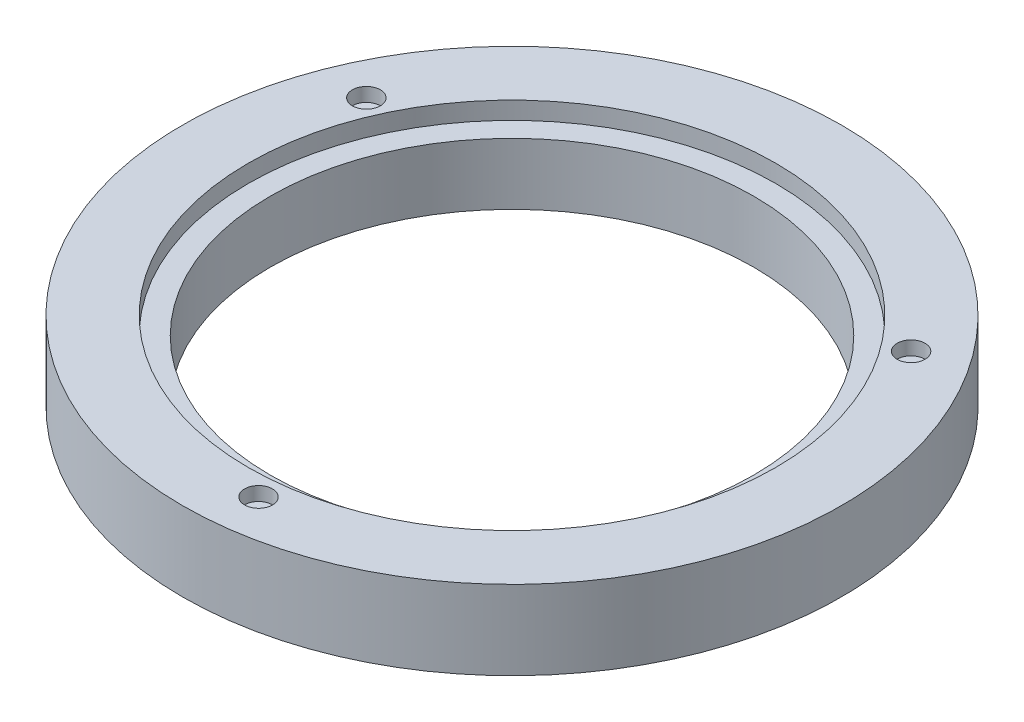
ISO-10303-21;
HEADER;
FILE_DESCRIPTION(('STEP AP214'),'2;1');
FILE_NAME('part.step','',(''),(''),'','','');
FILE_SCHEMA(('AUTOMOTIVE_DESIGN { 1 0 10303 214 1 1 1 1 }'));
ENDSEC;
DATA;
#1=APPLICATION_CONTEXT('core data for automotive mechanical design processes');
#2=APPLICATION_PROTOCOL_DEFINITION('international standard','automotive_design',2000,#1);
#3=PRODUCT_CONTEXT('',#1,'mechanical');
#4=PRODUCT('Part','Part','',(#3));
#5=PRODUCT_RELATED_PRODUCT_CATEGORY('part','',(#4));
#6=PRODUCT_DEFINITION_FORMATION('','',#4);
#7=PRODUCT_DEFINITION_CONTEXT('part definition',#1,'design');
#8=PRODUCT_DEFINITION('design','',#6,#7);
#9=PRODUCT_DEFINITION_SHAPE('','',#8);
#10=(LENGTH_UNIT() NAMED_UNIT(*) SI_UNIT(.MILLI.,.METRE.));
#11=(NAMED_UNIT(*) PLANE_ANGLE_UNIT() SI_UNIT($,.RADIAN.));
#12=(NAMED_UNIT(*) SI_UNIT($,.STERADIAN.) SOLID_ANGLE_UNIT());
#13=UNCERTAINTY_MEASURE_WITH_UNIT(LENGTH_MEASURE(1.E-05),#10,'distance_accuracy_value','');
#14=(GEOMETRIC_REPRESENTATION_CONTEXT(3) GLOBAL_UNCERTAINTY_ASSIGNED_CONTEXT((#13)) GLOBAL_UNIT_ASSIGNED_CONTEXT((#10,
#11,#12)) REPRESENTATION_CONTEXT('',''));
#15=CARTESIAN_POINT('',(0.,0.,0.));
#16=DIRECTION('',(0.,0.,1.));
#17=DIRECTION('',(1.,0.,0.));
#18=AXIS2_PLACEMENT_3D('',#15,#16,#17);
#19=CARTESIAN_POINT('',(0.,18.,0.));
#20=DIRECTION('',(0.,-1.,0.));
#21=DIRECTION('',(0.,0.,-1.));
#22=AXIS2_PLACEMENT_3D('',#19,#20,#21);
#23=CYLINDRICAL_SURFACE('',#22,55.);
#24=CARTESIAN_POINT('',(0.,0.,0.));
#25=DIRECTION('',(0.,1.,0.));
#26=DIRECTION('',(0.,0.,1.));
#27=AXIS2_PLACEMENT_3D('',#24,#25,#26);
#28=CIRCLE('',#27,55.);
#29=CARTESIAN_POINT('',(0.,0.,55.));
#30=VERTEX_POINT('',#29);
#31=EDGE_CURVE('E44',#30,#30,#28,.T.);
#32=ORIENTED_EDGE('',*,*,#31,.F.);
#33=EDGE_LOOP('',(#32));
#34=FACE_BOUND('',#33,.T.);
#35=CARTESIAN_POINT('',(0.,14.,0.));
#36=DIRECTION('',(0.,1.,0.));
#37=DIRECTION('',(0.,0.,1.));
#38=AXIS2_PLACEMENT_3D('',#35,#36,#37);
#39=CIRCLE('',#38,55.);
#40=CARTESIAN_POINT('',(0.,14.,55.));
#41=VERTEX_POINT('',#40);
#42=EDGE_CURVE('E52',#41,#41,#39,.T.);
#43=ORIENTED_EDGE('',*,*,#42,.T.);
#44=EDGE_LOOP('',(#43));
#45=FACE_BOUND('',#44,.T.);
#46=ADVANCED_FACE('F33',(#34,#45),#23,.F.);
#47=CARTESIAN_POINT('',(0.,18.,0.));
#48=DIRECTION('',(0.,1.,0.));
#49=DIRECTION('',(0.,0.,1.));
#50=AXIS2_PLACEMENT_3D('',#47,#48,#49);
#51=PLANE('',#50);
#52=CARTESIAN_POINT('',(52.4970437890116,18.,-38.3283236447266));
#53=DIRECTION('',(0.,1.,0.));
#54=DIRECTION('',(0.,0.,1.));
#55=AXIS2_PLACEMENT_3D('',#52,#53,#54);
#56=CIRCLE('',#55,3.17500000000468);
#57=CARTESIAN_POINT('',(52.4970437890116,18.,-35.153323644722));
#58=VERTEX_POINT('',#57);
#59=EDGE_CURVE('E71',#58,#58,#56,.T.);
#60=ORIENTED_EDGE('',*,*,#59,.F.);
#61=EDGE_LOOP('',(#60));
#62=FACE_BOUND('',#61,.T.);
#63=CARTESIAN_POINT('',(6.9447800662988,18.,64.6279353672267));
#64=DIRECTION('',(0.,1.,0.));
#65=DIRECTION('',(0.,0.,1.));
#66=AXIS2_PLACEMENT_3D('',#63,#64,#65);
#67=CIRCLE('',#66,3.17500000000137);
#68=CARTESIAN_POINT('',(6.9447800662988,18.,67.8029353672281));
#69=VERTEX_POINT('',#68);
#70=EDGE_CURVE('E64',#69,#69,#67,.T.);
#71=ORIENTED_EDGE('',*,*,#70,.F.);
#72=EDGE_LOOP('',(#71));
#73=FACE_BOUND('',#72,.T.);
#74=CARTESIAN_POINT('',(-59.441823855307,18.,-26.2996117225076));
#75=DIRECTION('',(0.,1.,0.));
#76=DIRECTION('',(0.,0.,1.));
#77=AXIS2_PLACEMENT_3D('',#74,#75,#76);
#78=CIRCLE('',#77,3.175);
#79=CARTESIAN_POINT('',(-59.441823855307,18.,-23.1246117225076));
#80=VERTEX_POINT('',#79);
#81=EDGE_CURVE('E58',#80,#80,#78,.T.);
#82=ORIENTED_EDGE('',*,*,#81,.F.);
#83=EDGE_LOOP('',(#82));
#84=FACE_BOUND('',#83,.T.);
#85=CARTESIAN_POINT('',(0.,18.,0.));
#86=DIRECTION('',(0.,1.,0.));
#87=DIRECTION('',(0.,0.,1.));
#88=AXIS2_PLACEMENT_3D('',#85,#86,#87);
#89=CIRCLE('',#88,60.);
#90=CARTESIAN_POINT('',(0.,18.,60.));
#91=VERTEX_POINT('',#90);
#92=EDGE_CURVE('E49',#91,#91,#89,.T.);
#93=ORIENTED_EDGE('',*,*,#92,.F.);
#94=EDGE_LOOP('',(#93));
#95=FACE_BOUND('',#94,.T.);
#96=CARTESIAN_POINT('',(0.,18.,0.));
#97=DIRECTION('',(0.,1.,0.));
#98=DIRECTION('',(0.,0.,1.));
#99=AXIS2_PLACEMENT_3D('',#96,#97,#98);
#100=CIRCLE('',#99,75.);
#101=CARTESIAN_POINT('',(0.,18.,75.));
#102=VERTEX_POINT('',#101);
#103=EDGE_CURVE('E10',#102,#102,#100,.T.);
#104=ORIENTED_EDGE('',*,*,#103,.T.);
#105=EDGE_LOOP('',(#104));
#106=FACE_BOUND('',#105,.T.);
#107=ADVANCED_FACE('F106',(#62,#73,#84,#95,#106),#51,.T.);
#108=CARTESIAN_POINT('',(0.,0.,0.));
#109=DIRECTION('',(0.,1.,0.));
#110=DIRECTION('',(0.,0.,1.));
#111=AXIS2_PLACEMENT_3D('',#108,#109,#110);
#112=PLANE('',#111);
#113=CARTESIAN_POINT('',(-6.94478006629941,0.,-64.6279353672315));
#114=DIRECTION('',(0.,-1.,0.));
#115=DIRECTION('',(0.,0.,-1.));
#116=AXIS2_PLACEMENT_3D('',#113,#114,#115);
#117=CIRCLE('',#116,3.175);
#118=CARTESIAN_POINT('',(-6.94478006629941,0.,-67.8029353672315));
#119=VERTEX_POINT('',#118);
#120=EDGE_CURVE('E88',#119,#119,#117,.T.);
#121=ORIENTED_EDGE('',*,*,#120,.F.);
#122=EDGE_LOOP('',(#121));
#123=FACE_BOUND('',#122,.T.);
#124=CARTESIAN_POINT('',(-52.4970437890114,0.,38.3283236447271));
#125=DIRECTION('',(0.,-1.,0.));
#126=DIRECTION('',(0.,0.,-1.));
#127=AXIS2_PLACEMENT_3D('',#124,#125,#126);
#128=CIRCLE('',#127,3.175);
#129=CARTESIAN_POINT('',(-52.4970437890114,0.,35.1533236447271));
#130=VERTEX_POINT('',#129);
#131=EDGE_CURVE('E82',#130,#130,#128,.T.);
#132=ORIENTED_EDGE('',*,*,#131,.F.);
#133=EDGE_LOOP('',(#132));
#134=FACE_BOUND('',#133,.T.);
#135=CARTESIAN_POINT('',(59.4418238553113,0.,26.2996117225047));
#136=DIRECTION('',(0.,-1.,0.));
#137=DIRECTION('',(0.,0.,-1.));
#138=AXIS2_PLACEMENT_3D('',#135,#136,#137);
#139=CIRCLE('',#138,3.175);
#140=CARTESIAN_POINT('',(59.4418238553113,0.,23.1246117225047));
#141=VERTEX_POINT('',#140);
#142=EDGE_CURVE('E76',#141,#141,#139,.T.);
#143=ORIENTED_EDGE('',*,*,#142,.F.);
#144=EDGE_LOOP('',(#143));
#145=FACE_BOUND('',#144,.T.);
#146=CARTESIAN_POINT('',(0.,0.,0.));
#147=DIRECTION('',(0.,1.,0.));
#148=DIRECTION('',(0.,0.,1.));
#149=AXIS2_PLACEMENT_3D('',#146,#147,#148);
#150=CIRCLE('',#149,75.);
#151=CARTESIAN_POINT('',(0.,0.,75.));
#152=VERTEX_POINT('',#151);
#153=EDGE_CURVE('E37',#152,#152,#150,.T.);
#154=ORIENTED_EDGE('',*,*,#153,.F.);
#155=EDGE_LOOP('',(#154));
#156=FACE_BOUND('',#155,.T.);
#157=ORIENTED_EDGE('',*,*,#31,.T.);
#158=EDGE_LOOP('',(#157));
#159=FACE_BOUND('',#158,.T.);
#160=ADVANCED_FACE('F103',(#123,#134,#145,#156,#159),#112,.F.);
#161=CARTESIAN_POINT('',(0.,18.,0.));
#162=DIRECTION('',(0.,-1.,0.));
#163=DIRECTION('',(0.,0.,-1.));
#164=AXIS2_PLACEMENT_3D('',#161,#162,#163);
#165=CYLINDRICAL_SURFACE('',#164,75.);
#166=ORIENTED_EDGE('',*,*,#103,.F.);
#167=EDGE_LOOP('',(#166));
#168=FACE_BOUND('',#167,.T.);
#169=ORIENTED_EDGE('',*,*,#153,.T.);
#170=EDGE_LOOP('',(#169));
#171=FACE_BOUND('',#170,.T.);
#172=ADVANCED_FACE('F35',(#168,#171),#165,.T.);
#173=CARTESIAN_POINT('',(0.,14.,0.));
#174=DIRECTION('',(0.,1.,0.));
#175=DIRECTION('',(0.,0.,1.));
#176=AXIS2_PLACEMENT_3D('',#173,#174,#175);
#177=CYLINDRICAL_SURFACE('',#176,60.);
#178=CARTESIAN_POINT('',(0.,14.,0.));
#179=DIRECTION('',(0.,1.,0.));
#180=DIRECTION('',(0.,0.,1.));
#181=AXIS2_PLACEMENT_3D('',#178,#179,#180);
#182=CIRCLE('',#181,60.);
#183=CARTESIAN_POINT('',(0.,14.,60.));
#184=VERTEX_POINT('',#183);
#185=EDGE_CURVE('E48',#184,#184,#182,.T.);
#186=ORIENTED_EDGE('',*,*,#185,.F.);
#187=EDGE_LOOP('',(#186));
#188=FACE_BOUND('',#187,.T.);
#189=ORIENTED_EDGE('',*,*,#92,.T.);
#190=EDGE_LOOP('',(#189));
#191=FACE_BOUND('',#190,.T.);
#192=ADVANCED_FACE('F124',(#188,#191),#177,.F.);
#193=CARTESIAN_POINT('',(0.,14.,0.));
#194=DIRECTION('',(0.,1.,0.));
#195=DIRECTION('',(0.,0.,1.));
#196=AXIS2_PLACEMENT_3D('',#193,#194,#195);
#197=PLANE('',#196);
#198=ORIENTED_EDGE('',*,*,#42,.F.);
#199=EDGE_LOOP('',(#198));
#200=FACE_BOUND('',#199,.T.);
#201=ORIENTED_EDGE('',*,*,#185,.T.);
#202=EDGE_LOOP('',(#201));
#203=FACE_BOUND('',#202,.T.);
#204=ADVANCED_FACE('F120',(#200,#203),#197,.T.);
#205=CARTESIAN_POINT('',(-59.441823855307,14.85,-26.2996117225076));
#206=DIRECTION('',(0.,1.,0.));
#207=DIRECTION('',(0.,0.,1.));
#208=AXIS2_PLACEMENT_3D('',#205,#206,#207);
#209=CYLINDRICAL_SURFACE('',#208,3.175);
#210=CARTESIAN_POINT('',(-59.441823855307,14.85,-26.2996117225076));
#211=DIRECTION('',(0.,1.,0.));
#212=DIRECTION('',(0.,0.,1.));
#213=AXIS2_PLACEMENT_3D('',#210,#211,#212);
#214=CIRCLE('',#213,3.175);
#215=CARTESIAN_POINT('',(-59.441823855307,14.85,-23.1246117225076));
#216=VERTEX_POINT('',#215);
#217=EDGE_CURVE('E57',#216,#216,#214,.T.);
#218=ORIENTED_EDGE('',*,*,#217,.F.);
#219=EDGE_LOOP('',(#218));
#220=FACE_BOUND('',#219,.T.);
#221=ORIENTED_EDGE('',*,*,#81,.T.);
#222=EDGE_LOOP('',(#221));
#223=FACE_BOUND('',#222,.T.);
#224=ADVANCED_FACE('F123',(#220,#223),#209,.F.);
#225=CARTESIAN_POINT('',(-59.441823855307,14.85,-26.2996117225076));
#226=DIRECTION('',(0.,1.,0.));
#227=DIRECTION('',(0.,0.,1.));
#228=AXIS2_PLACEMENT_3D('',#225,#226,#227);
#229=PLANE('',#228);
#230=ORIENTED_EDGE('',*,*,#217,.T.);
#231=EDGE_LOOP('',(#230));
#232=FACE_BOUND('',#231,.T.);
#233=ADVANCED_FACE('F143',(#232),#229,.T.);
#234=CARTESIAN_POINT('',(6.9447800662988,14.85,64.6279353672267));
#235=DIRECTION('',(0.,1.,0.));
#236=DIRECTION('',(0.,0.,1.));
#237=AXIS2_PLACEMENT_3D('',#234,#235,#236);
#238=CYLINDRICAL_SURFACE('',#237,3.17500000000137);
#239=CARTESIAN_POINT('',(6.9447800662988,14.85,64.6279353672267));
#240=DIRECTION('',(0.,1.,0.));
#241=DIRECTION('',(0.,0.,1.));
#242=AXIS2_PLACEMENT_3D('',#239,#240,#241);
#243=CIRCLE('',#242,3.17500000000137);
#244=CARTESIAN_POINT('',(6.9447800662988,14.85,67.8029353672281));
#245=VERTEX_POINT('',#244);
#246=EDGE_CURVE('E67',#245,#245,#243,.T.);
#247=ORIENTED_EDGE('',*,*,#246,.F.);
#248=EDGE_LOOP('',(#247));
#249=FACE_BOUND('',#248,.T.);
#250=ORIENTED_EDGE('',*,*,#70,.T.);
#251=EDGE_LOOP('',(#250));
#252=FACE_BOUND('',#251,.T.);
#253=ADVANCED_FACE('F147',(#249,#252),#238,.F.);
#254=CARTESIAN_POINT('',(6.9447800662988,14.85,64.6279353672267));
#255=DIRECTION('',(0.,1.,0.));
#256=DIRECTION('',(0.,0.,1.));
#257=AXIS2_PLACEMENT_3D('',#254,#255,#256);
#258=PLANE('',#257);
#259=ORIENTED_EDGE('',*,*,#246,.T.);
#260=EDGE_LOOP('',(#259));
#261=FACE_BOUND('',#260,.T.);
#262=ADVANCED_FACE('F151',(#261),#258,.T.);
#263=CARTESIAN_POINT('',(52.4970437890116,14.85,-38.3283236447266));
#264=DIRECTION('',(0.,1.,0.));
#265=DIRECTION('',(0.,0.,1.));
#266=AXIS2_PLACEMENT_3D('',#263,#264,#265);
#267=CYLINDRICAL_SURFACE('',#266,3.17500000000468);
#268=CARTESIAN_POINT('',(52.4970437890116,14.85,-38.3283236447266));
#269=DIRECTION('',(0.,1.,0.));
#270=DIRECTION('',(0.,0.,1.));
#271=AXIS2_PLACEMENT_3D('',#268,#269,#270);
#272=CIRCLE('',#271,3.17500000000468);
#273=CARTESIAN_POINT('',(52.4970437890116,14.85,-35.153323644722));
#274=VERTEX_POINT('',#273);
#275=EDGE_CURVE('E61',#274,#274,#272,.T.);
#276=ORIENTED_EDGE('',*,*,#275,.F.);
#277=EDGE_LOOP('',(#276));
#278=FACE_BOUND('',#277,.T.);
#279=ORIENTED_EDGE('',*,*,#59,.T.);
#280=EDGE_LOOP('',(#279));
#281=FACE_BOUND('',#280,.T.);
#282=ADVANCED_FACE('F155',(#278,#281),#267,.F.);
#283=CARTESIAN_POINT('',(52.4970437890116,14.85,-38.3283236447266));
#284=DIRECTION('',(0.,1.,0.));
#285=DIRECTION('',(0.,0.,1.));
#286=AXIS2_PLACEMENT_3D('',#283,#284,#285);
#287=PLANE('',#286);
#288=ORIENTED_EDGE('',*,*,#275,.T.);
#289=EDGE_LOOP('',(#288));
#290=FACE_BOUND('',#289,.T.);
#291=ADVANCED_FACE('F159',(#290),#287,.T.);
#292=CARTESIAN_POINT('',(59.4418238553113,3.15,26.2996117225047));
#293=DIRECTION('',(0.,-1.,0.));
#294=DIRECTION('',(0.,0.,-1.));
#295=AXIS2_PLACEMENT_3D('',#292,#293,#294);
#296=CYLINDRICAL_SURFACE('',#295,3.175);
#297=CARTESIAN_POINT('',(59.4418238553113,3.15,26.2996117225047));
#298=DIRECTION('',(0.,-1.,0.));
#299=DIRECTION('',(0.,0.,-1.));
#300=AXIS2_PLACEMENT_3D('',#297,#298,#299);
#301=CIRCLE('',#300,3.175);
#302=CARTESIAN_POINT('',(59.4418238553113,3.15,23.1246117225047));
#303=VERTEX_POINT('',#302);
#304=EDGE_CURVE('E68',#303,#303,#301,.T.);
#305=ORIENTED_EDGE('',*,*,#304,.F.);
#306=EDGE_LOOP('',(#305));
#307=FACE_BOUND('',#306,.T.);
#308=ORIENTED_EDGE('',*,*,#142,.T.);
#309=EDGE_LOOP('',(#308));
#310=FACE_BOUND('',#309,.T.);
#311=ADVANCED_FACE('F163',(#307,#310),#296,.F.);
#312=CARTESIAN_POINT('',(59.4418238553113,3.15,26.2996117225047));
#313=DIRECTION('',(0.,-1.,0.));
#314=DIRECTION('',(0.,0.,-1.));
#315=AXIS2_PLACEMENT_3D('',#312,#313,#314);
#316=PLANE('',#315);
#317=ORIENTED_EDGE('',*,*,#304,.T.);
#318=EDGE_LOOP('',(#317));
#319=FACE_BOUND('',#318,.T.);
#320=ADVANCED_FACE('F167',(#319),#316,.T.);
#321=CARTESIAN_POINT('',(-52.4970437890114,3.15,38.3283236447271));
#322=DIRECTION('',(0.,-1.,0.));
#323=DIRECTION('',(0.,0.,-1.));
#324=AXIS2_PLACEMENT_3D('',#321,#322,#323);
#325=CYLINDRICAL_SURFACE('',#324,3.175);
#326=CARTESIAN_POINT('',(-52.4970437890114,3.15,38.3283236447271));
#327=DIRECTION('',(0.,-1.,0.));
#328=DIRECTION('',(0.,0.,-1.));
#329=AXIS2_PLACEMENT_3D('',#326,#327,#328);
#330=CIRCLE('',#329,3.175);
#331=CARTESIAN_POINT('',(-52.4970437890114,3.15,35.1533236447271));
#332=VERTEX_POINT('',#331);
#333=EDGE_CURVE('E85',#332,#332,#330,.T.);
#334=ORIENTED_EDGE('',*,*,#333,.F.);
#335=EDGE_LOOP('',(#334));
#336=FACE_BOUND('',#335,.T.);
#337=ORIENTED_EDGE('',*,*,#131,.T.);
#338=EDGE_LOOP('',(#337));
#339=FACE_BOUND('',#338,.T.);
#340=ADVANCED_FACE('F171',(#336,#339),#325,.F.);
#341=CARTESIAN_POINT('',(-52.4970437890114,3.15,38.3283236447271));
#342=DIRECTION('',(0.,-1.,0.));
#343=DIRECTION('',(0.,0.,-1.));
#344=AXIS2_PLACEMENT_3D('',#341,#342,#343);
#345=PLANE('',#344);
#346=ORIENTED_EDGE('',*,*,#333,.T.);
#347=EDGE_LOOP('',(#346));
#348=FACE_BOUND('',#347,.T.);
#349=ADVANCED_FACE('F99',(#348),#345,.T.);
#350=CARTESIAN_POINT('',(-6.94478006629941,3.15,-64.6279353672315));
#351=DIRECTION('',(0.,-1.,0.));
#352=DIRECTION('',(0.,0.,-1.));
#353=AXIS2_PLACEMENT_3D('',#350,#351,#352);
#354=CYLINDRICAL_SURFACE('',#353,3.175);
#355=CARTESIAN_POINT('',(-6.94478006629941,3.15,-64.6279353672315));
#356=DIRECTION('',(0.,-1.,0.));
#357=DIRECTION('',(0.,0.,-1.));
#358=AXIS2_PLACEMENT_3D('',#355,#356,#357);
#359=CIRCLE('',#358,3.175);
#360=CARTESIAN_POINT('',(-6.94478006629941,3.15,-67.8029353672315));
#361=VERTEX_POINT('',#360);
#362=EDGE_CURVE('E79',#361,#361,#359,.T.);
#363=ORIENTED_EDGE('',*,*,#362,.F.);
#364=EDGE_LOOP('',(#363));
#365=FACE_BOUND('',#364,.T.);
#366=ORIENTED_EDGE('',*,*,#120,.T.);
#367=EDGE_LOOP('',(#366));
#368=FACE_BOUND('',#367,.T.);
#369=ADVANCED_FACE('F96',(#365,#368),#354,.F.);
#370=CARTESIAN_POINT('',(-6.94478006629941,3.15,-64.6279353672315));
#371=DIRECTION('',(0.,-1.,0.));
#372=DIRECTION('',(0.,0.,-1.));
#373=AXIS2_PLACEMENT_3D('',#370,#371,#372);
#374=PLANE('',#373);
#375=ORIENTED_EDGE('',*,*,#362,.T.);
#376=EDGE_LOOP('',(#375));
#377=FACE_BOUND('',#376,.T.);
#378=ADVANCED_FACE('F94',(#377),#374,.T.);
#379=CLOSED_SHELL('',(#46,#107,#160,#172,#192,#204,#224,#233,#253,#262,#282,#291,#311,#320,#340,
#349,#369,#378));
#380=MANIFOLD_SOLID_BREP('B2',#379);
#381=ADVANCED_BREP_SHAPE_REPRESENTATION('',(#18,#380),#14);
#382=SHAPE_DEFINITION_REPRESENTATION(#9,#381);
ENDSEC;
END-ISO-10303-21;
